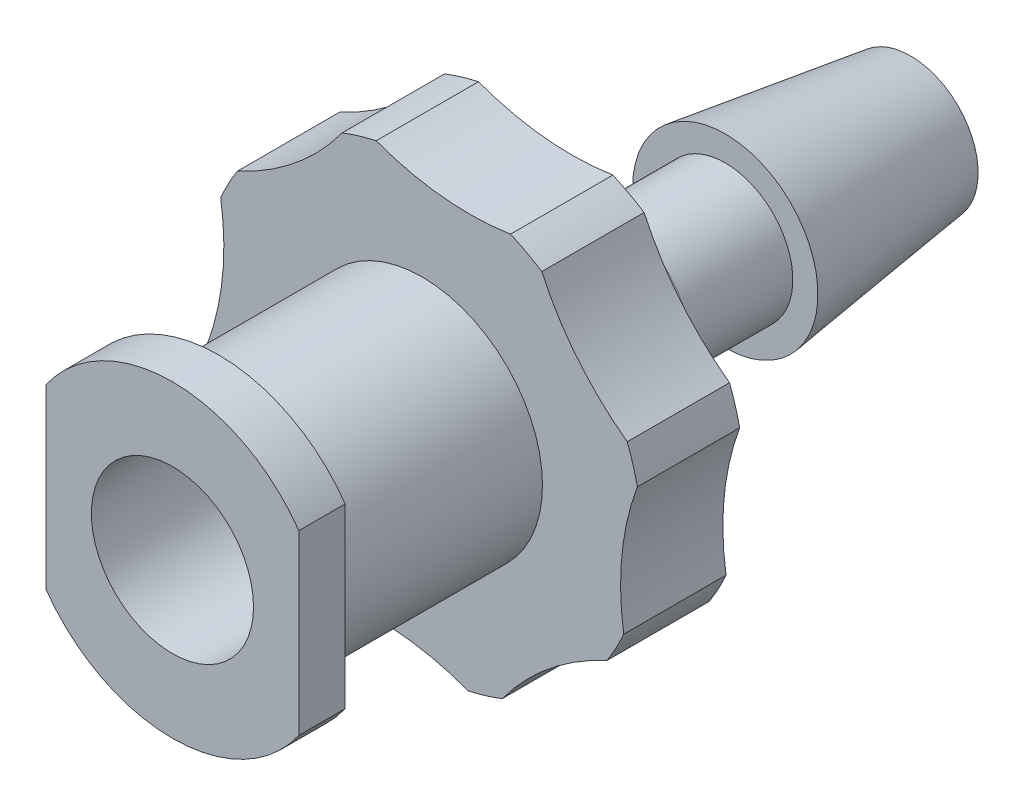
ISO-10303-21;
HEADER;
FILE_DESCRIPTION(('STEP AP214'),'2;1');
FILE_NAME('part.step','',(''),(''),'','','');
FILE_SCHEMA(('AUTOMOTIVE_DESIGN { 1 0 10303 214 1 1 1 1 }'));
ENDSEC;
DATA;
#1=APPLICATION_CONTEXT('core data for automotive mechanical design processes');
#2=APPLICATION_PROTOCOL_DEFINITION('international standard','automotive_design',2000,#1);
#3=PRODUCT_CONTEXT('',#1,'mechanical');
#4=PRODUCT('Part','Part','',(#3));
#5=PRODUCT_RELATED_PRODUCT_CATEGORY('part','',(#4));
#6=PRODUCT_DEFINITION_FORMATION('','',#4);
#7=PRODUCT_DEFINITION_CONTEXT('part definition',#1,'design');
#8=PRODUCT_DEFINITION('design','',#6,#7);
#9=PRODUCT_DEFINITION_SHAPE('','',#8);
#10=(LENGTH_UNIT() NAMED_UNIT(*) SI_UNIT(.MILLI.,.METRE.));
#11=(NAMED_UNIT(*) PLANE_ANGLE_UNIT() SI_UNIT($,.RADIAN.));
#12=(NAMED_UNIT(*) SI_UNIT($,.STERADIAN.) SOLID_ANGLE_UNIT());
#13=UNCERTAINTY_MEASURE_WITH_UNIT(LENGTH_MEASURE(1.E-05),#10,'distance_accuracy_value','');
#14=(GEOMETRIC_REPRESENTATION_CONTEXT(3) GLOBAL_UNCERTAINTY_ASSIGNED_CONTEXT((#13)) GLOBAL_UNIT_ASSIGNED_CONTEXT((#10,
#11,#12)) REPRESENTATION_CONTEXT('',''));
#15=CARTESIAN_POINT('',(0.,0.,0.));
#16=DIRECTION('',(0.,0.,1.));
#17=DIRECTION('',(1.,0.,0.));
#18=AXIS2_PLACEMENT_3D('',#15,#16,#17);
#19=CARTESIAN_POINT('',(0.,0.,10.56515173538));
#20=DIRECTION('',(0.,0.,1.));
#21=DIRECTION('',(1.,0.,0.));
#22=AXIS2_PLACEMENT_3D('',#19,#20,#21);
#23=CYLINDRICAL_SURFACE('',#22,3.705);
#24=DIRECTION('',(0.,0.,1.));
#25=VECTOR('',#24,1.);
#26=CARTESIAN_POINT('',(-2.01342596186961,-3.11016734213276,10.56515173538));
#27=LINE('',#26,#25);
#28=CARTESIAN_POINT('',(-2.01342596186961,-3.11016734213276,10.56515173538));
#29=VERTEX_POINT('',#28);
#30=CARTESIAN_POINT('',(-2.01342596186963,-3.11016734213279,12.28765173538));
#31=VERTEX_POINT('',#30);
#32=EDGE_CURVE('E50',#29,#31,#27,.T.);
#33=ORIENTED_EDGE('',*,*,#32,.F.);
#34=CARTESIAN_POINT('',(0.,0.,10.56515173538));
#35=DIRECTION('',(0.,0.,1.));
#36=DIRECTION('',(-1.,0.,0.));
#37=AXIS2_PLACEMENT_3D('',#34,#35,#36);
#38=CIRCLE('',#37,3.705);
#39=CARTESIAN_POINT('',(-1.48785096001638,-3.39312901622943,10.56515173538));
#40=VERTEX_POINT('',#39);
#41=EDGE_CURVE('E188',#29,#40,#38,.T.);
#42=ORIENTED_EDGE('',*,*,#41,.T.);
#43=DIRECTION('',(0.,0.,1.));
#44=VECTOR('',#43,1.);
#45=CARTESIAN_POINT('',(-1.48785096001638,-3.39312901622943,10.56515173538));
#46=LINE('',#45,#44);
#47=CARTESIAN_POINT('',(-1.48785096001638,-3.39312901622943,12.28765173538));
#48=VERTEX_POINT('',#47);
#49=EDGE_CURVE('E283',#40,#48,#46,.T.);
#50=ORIENTED_EDGE('',*,*,#49,.T.);
#51=CARTESIAN_POINT('',(0.,0.,12.28765173538));
#52=DIRECTION('',(0.,0.,1.));
#53=DIRECTION('',(-1.,0.,0.));
#54=AXIS2_PLACEMENT_3D('',#51,#52,#53);
#55=CIRCLE('',#54,3.705);
#56=EDGE_CURVE('E210',#31,#48,#55,.T.);
#57=ORIENTED_EDGE('',*,*,#56,.F.);
#58=EDGE_LOOP('',(#33,#42,#50,#57));
#59=FACE_BOUND('',#58,.T.);
#60=ADVANCED_FACE('F35',(#59),#23,.T.);
#61=DIRECTION('',(0.,0.,1.));
#62=VECTOR('',#61,1.);
#63=CARTESIAN_POINT('',(0.775513267191958,-3.62292756930207,10.56515173538));
#64=LINE('',#63,#62);
#65=CARTESIAN_POINT('',(0.775513267191958,-3.62292756930207,10.56515173538));
#66=VERTEX_POINT('',#65);
#67=CARTESIAN_POINT('',(0.775513267191965,-3.6229275693021,12.28765173538));
#68=VERTEX_POINT('',#67);
#69=EDGE_CURVE('E58',#66,#68,#64,.T.);
#70=ORIENTED_EDGE('',*,*,#69,.F.);
#71=CARTESIAN_POINT('',(1.34723503359417,-3.45137404003917,10.56515173538));
#72=VERTEX_POINT('',#71);
#73=EDGE_CURVE('E199',#66,#72,#38,.T.);
#74=ORIENTED_EDGE('',*,*,#73,.T.);
#75=DIRECTION('',(0.,0.,1.));
#76=VECTOR('',#75,1.);
#77=CARTESIAN_POINT('',(1.34723503359417,-3.45137404003917,10.56515173538));
#78=LINE('',#77,#76);
#79=CARTESIAN_POINT('',(1.34723503359417,-3.45137404003917,12.28765173538));
#80=VERTEX_POINT('',#79);
#81=EDGE_CURVE('E273',#72,#80,#78,.T.);
#82=ORIENTED_EDGE('',*,*,#81,.T.);
#83=EDGE_CURVE('E214',#68,#80,#55,.T.);
#84=ORIENTED_EDGE('',*,*,#83,.F.);
#85=EDGE_LOOP('',(#70,#74,#82,#84));
#86=FACE_BOUND('',#85,.T.);
#87=ADVANCED_FACE('F388',(#86),#23,.T.);
#88=DIRECTION('',(0.,0.,1.));
#89=VECTOR('',#88,1.);
#90=CARTESIAN_POINT('',(3.11016734213276,-2.01342596186962,10.56515173538));
#91=LINE('',#90,#89);
#92=CARTESIAN_POINT('',(3.11016734213276,-2.01342596186962,10.56515173538));
#93=VERTEX_POINT('',#92);
#94=CARTESIAN_POINT('',(3.11016734213279,-2.01342596186964,12.28765173538));
#95=VERTEX_POINT('',#94);
#96=EDGE_CURVE('E270',#93,#95,#91,.T.);
#97=ORIENTED_EDGE('',*,*,#96,.F.);
#98=CARTESIAN_POINT('',(3.39312901622943,-1.48785096001638,10.56515173538));
#99=VERTEX_POINT('',#98);
#100=EDGE_CURVE('E682',#93,#99,#38,.T.);
#101=ORIENTED_EDGE('',*,*,#100,.T.);
#102=DIRECTION('',(0.,0.,1.));
#103=VECTOR('',#102,1.);
#104=CARTESIAN_POINT('',(3.39312901622943,-1.48785096001638,10.56515173538));
#105=LINE('',#104,#103);
#106=CARTESIAN_POINT('',(3.39312901622943,-1.48785096001638,12.28765173538));
#107=VERTEX_POINT('',#106);
#108=EDGE_CURVE('E262',#99,#107,#105,.T.);
#109=ORIENTED_EDGE('',*,*,#108,.T.);
#110=EDGE_CURVE('E684',#95,#107,#55,.T.);
#111=ORIENTED_EDGE('',*,*,#110,.F.);
#112=EDGE_LOOP('',(#97,#101,#109,#111));
#113=FACE_BOUND('',#112,.T.);
#114=ADVANCED_FACE('F394',(#113),#23,.T.);
#115=DIRECTION('',(0.,0.,1.));
#116=VECTOR('',#115,1.);
#117=CARTESIAN_POINT('',(3.62292756930207,0.775513267191958,10.56515173538));
#118=LINE('',#117,#116);
#119=CARTESIAN_POINT('',(3.62292756930207,0.775513267191958,10.56515173538));
#120=VERTEX_POINT('',#119);
#121=CARTESIAN_POINT('',(3.6229275693021,0.775513267191965,12.28765173538));
#122=VERTEX_POINT('',#121);
#123=EDGE_CURVE('E259',#120,#122,#118,.T.);
#124=ORIENTED_EDGE('',*,*,#123,.F.);
#125=CARTESIAN_POINT('',(3.45137404003917,1.34723503359417,10.56515173538));
#126=VERTEX_POINT('',#125);
#127=EDGE_CURVE('E688',#120,#126,#38,.T.);
#128=ORIENTED_EDGE('',*,*,#127,.T.);
#129=DIRECTION('',(0.,0.,1.));
#130=VECTOR('',#129,1.);
#131=CARTESIAN_POINT('',(3.45137404003917,1.34723503359417,10.56515173538));
#132=LINE('',#131,#130);
#133=CARTESIAN_POINT('',(3.45137404003917,1.34723503359417,12.28765173538));
#134=VERTEX_POINT('',#133);
#135=EDGE_CURVE('E251',#126,#134,#132,.T.);
#136=ORIENTED_EDGE('',*,*,#135,.T.);
#137=EDGE_CURVE('E700',#122,#134,#55,.T.);
#138=ORIENTED_EDGE('',*,*,#137,.F.);
#139=EDGE_LOOP('',(#124,#128,#136,#138));
#140=FACE_BOUND('',#139,.T.);
#141=ADVANCED_FACE('F653',(#140),#23,.T.);
#142=DIRECTION('',(0.,0.,1.));
#143=VECTOR('',#142,1.);
#144=CARTESIAN_POINT('',(2.01342596186962,3.11016734213276,10.56515173538));
#145=LINE('',#144,#143);
#146=CARTESIAN_POINT('',(2.01342596186962,3.11016734213276,10.56515173538));
#147=VERTEX_POINT('',#146);
#148=CARTESIAN_POINT('',(2.01342596186964,3.11016734213279,12.28765173538));
#149=VERTEX_POINT('',#148);
#150=EDGE_CURVE('E248',#147,#149,#145,.T.);
#151=ORIENTED_EDGE('',*,*,#150,.F.);
#152=CARTESIAN_POINT('',(1.48785096001638,3.39312901622943,10.56515173538));
#153=VERTEX_POINT('',#152);
#154=EDGE_CURVE('E209',#147,#153,#38,.T.);
#155=ORIENTED_EDGE('',*,*,#154,.T.);
#156=DIRECTION('',(0.,0.,1.));
#157=VECTOR('',#156,1.);
#158=CARTESIAN_POINT('',(1.48785096001638,3.39312901622943,10.56515173538));
#159=LINE('',#158,#157);
#160=CARTESIAN_POINT('',(1.48785096001638,3.39312901622943,12.28765173538));
#161=VERTEX_POINT('',#160);
#162=EDGE_CURVE('E240',#153,#161,#159,.T.);
#163=ORIENTED_EDGE('',*,*,#162,.T.);
#164=EDGE_CURVE('E219',#149,#161,#55,.T.);
#165=ORIENTED_EDGE('',*,*,#164,.F.);
#166=EDGE_LOOP('',(#151,#155,#163,#165));
#167=FACE_BOUND('',#166,.T.);
#168=ADVANCED_FACE('F414',(#167),#23,.T.);
#169=DIRECTION('',(0.,0.,1.));
#170=VECTOR('',#169,1.);
#171=CARTESIAN_POINT('',(-0.775513267191957,3.62292756930207,10.56515173538));
#172=LINE('',#171,#170);
#173=CARTESIAN_POINT('',(-0.775513267191957,3.62292756930207,10.56515173538));
#174=VERTEX_POINT('',#173);
#175=CARTESIAN_POINT('',(-0.775513267191964,3.6229275693021,12.28765173538));
#176=VERTEX_POINT('',#175);
#177=EDGE_CURVE('E237',#174,#176,#172,.T.);
#178=ORIENTED_EDGE('',*,*,#177,.F.);
#179=CARTESIAN_POINT('',(-1.34723503359417,3.45137404003917,10.56515173538));
#180=VERTEX_POINT('',#179);
#181=EDGE_CURVE('E202',#174,#180,#38,.T.);
#182=ORIENTED_EDGE('',*,*,#181,.T.);
#183=DIRECTION('',(0.,0.,1.));
#184=VECTOR('',#183,1.);
#185=CARTESIAN_POINT('',(-1.34723503359417,3.45137404003917,10.56515173538));
#186=LINE('',#185,#184);
#187=CARTESIAN_POINT('',(-1.34723503359417,3.45137404003917,12.28765173538));
#188=VERTEX_POINT('',#187);
#189=EDGE_CURVE('E229',#180,#188,#186,.T.);
#190=ORIENTED_EDGE('',*,*,#189,.T.);
#191=EDGE_CURVE('E215',#176,#188,#55,.T.);
#192=ORIENTED_EDGE('',*,*,#191,.F.);
#193=EDGE_LOOP('',(#178,#182,#190,#192));
#194=FACE_BOUND('',#193,.T.);
#195=ADVANCED_FACE('F409',(#194),#23,.T.);
#196=DIRECTION('',(0.,0.,1.));
#197=VECTOR('',#196,1.);
#198=CARTESIAN_POINT('',(-3.11016734213276,2.01342596186962,10.56515173538));
#199=LINE('',#198,#197);
#200=CARTESIAN_POINT('',(-3.11016734213276,2.01342596186962,10.56515173538));
#201=VERTEX_POINT('',#200);
#202=CARTESIAN_POINT('',(-3.11016734213279,2.01342596186964,12.28765173538));
#203=VERTEX_POINT('',#202);
#204=EDGE_CURVE('E227',#201,#203,#199,.T.);
#205=ORIENTED_EDGE('',*,*,#204,.F.);
#206=CARTESIAN_POINT('',(-3.39312901622945,1.48785096001638,10.56515173538));
#207=VERTEX_POINT('',#206);
#208=EDGE_CURVE('E195',#201,#207,#38,.T.);
#209=ORIENTED_EDGE('',*,*,#208,.T.);
#210=DIRECTION('',(0.,0.,1.));
#211=VECTOR('',#210,1.);
#212=CARTESIAN_POINT('',(-3.39312901622945,1.48785096001638,10.56515173538));
#213=LINE('',#212,#211);
#214=CARTESIAN_POINT('',(-3.39312901622945,1.48785096001638,12.28765173538));
#215=VERTEX_POINT('',#214);
#216=EDGE_CURVE('E220',#207,#215,#213,.T.);
#217=ORIENTED_EDGE('',*,*,#216,.T.);
#218=EDGE_CURVE('E211',#203,#215,#55,.T.);
#219=ORIENTED_EDGE('',*,*,#218,.F.);
#220=EDGE_LOOP('',(#205,#209,#217,#219));
#221=FACE_BOUND('',#220,.T.);
#222=ADVANCED_FACE('F399',(#221),#23,.T.);
#223=CARTESIAN_POINT('',(0.,0.,15.71315173538));
#224=DIRECTION('',(0.,0.,1.));
#225=DIRECTION('',(1.,0.,0.));
#226=AXIS2_PLACEMENT_3D('',#223,#224,#225);
#227=CYLINDRICAL_SURFACE('',#226,2.6);
#228=CARTESIAN_POINT('',(0.,0.,16.49315173538));
#229=DIRECTION('',(0.,0.,1.));
#230=DIRECTION('',(1.,0.,0.));
#231=AXIS2_PLACEMENT_3D('',#228,#229,#230);
#232=CIRCLE('',#231,2.6);
#233=CARTESIAN_POINT('',(2.12875,1.4927904868065,16.49315173538));
#234=VERTEX_POINT('',#233);
#235=CARTESIAN_POINT('',(-2.12875,1.4927904868065,16.49315173538));
#236=VERTEX_POINT('',#235);
#237=EDGE_CURVE('E197',#234,#236,#232,.T.);
#238=ORIENTED_EDGE('',*,*,#237,.F.);
#239=DIRECTION('',(0.,0.,1.));
#240=VECTOR('',#239,1.);
#241=CARTESIAN_POINT('',(2.12875,1.4927904868065,15.71315173538));
#242=LINE('',#241,#240);
#243=CARTESIAN_POINT('',(2.12875,1.4927904868065,15.71315173538));
#244=VERTEX_POINT('',#243);
#245=EDGE_CURVE('E343',#244,#234,#242,.T.);
#246=ORIENTED_EDGE('',*,*,#245,.F.);
#247=CARTESIAN_POINT('',(0.,0.,15.71315173538));
#248=DIRECTION('',(0.,0.,1.));
#249=DIRECTION('',(1.,0.,0.));
#250=AXIS2_PLACEMENT_3D('',#247,#248,#249);
#251=CIRCLE('',#250,2.6);
#252=CARTESIAN_POINT('',(-2.12875,1.4927904868065,15.71315173538));
#253=VERTEX_POINT('',#252);
#254=EDGE_CURVE('E342',#244,#253,#251,.T.);
#255=ORIENTED_EDGE('',*,*,#254,.T.);
#256=DIRECTION('',(0.,0.,1.));
#257=VECTOR('',#256,1.);
#258=CARTESIAN_POINT('',(-2.12875,1.4927904868065,15.71315173538));
#259=LINE('',#258,#257);
#260=EDGE_CURVE('E350',#253,#236,#259,.T.);
#261=ORIENTED_EDGE('',*,*,#260,.T.);
#262=EDGE_LOOP('',(#238,#246,#255,#261));
#263=FACE_BOUND('',#262,.T.);
#264=ADVANCED_FACE('F374',(#263),#227,.T.);
#265=CARTESIAN_POINT('',(2.12875,-1.49279048680651,15.71315173538));
#266=DIRECTION('',(1.,0.,0.));
#267=DIRECTION('',(0.,1.,0.));
#268=AXIS2_PLACEMENT_3D('',#265,#266,#267);
#269=PLANE('',#268);
#270=DIRECTION('',(0.,1.,0.));
#271=VECTOR('',#270,1.);
#272=CARTESIAN_POINT('',(2.12875,-1.49279048680651,16.49315173538));
#273=LINE('',#272,#271);
#274=CARTESIAN_POINT('',(2.12875,-1.49279048680651,16.49315173538));
#275=VERTEX_POINT('',#274);
#276=EDGE_CURVE('E331',#275,#234,#273,.T.);
#277=ORIENTED_EDGE('',*,*,#276,.F.);
#278=DIRECTION('',(0.,0.,1.));
#279=VECTOR('',#278,1.);
#280=CARTESIAN_POINT('',(2.12875,-1.49279048680651,15.71315173538));
#281=LINE('',#280,#279);
#282=CARTESIAN_POINT('',(2.12875,-1.49279048680651,15.71315173538));
#283=VERTEX_POINT('',#282);
#284=EDGE_CURVE('E346',#283,#275,#281,.T.);
#285=ORIENTED_EDGE('',*,*,#284,.F.);
#286=DIRECTION('',(0.,1.,0.));
#287=VECTOR('',#286,1.);
#288=CARTESIAN_POINT('',(2.12875,-1.49279048680651,15.71315173538));
#289=LINE('',#288,#287);
#290=EDGE_CURVE('E337',#283,#244,#289,.T.);
#291=ORIENTED_EDGE('',*,*,#290,.T.);
#292=ORIENTED_EDGE('',*,*,#245,.T.);
#293=EDGE_LOOP('',(#277,#285,#291,#292));
#294=FACE_BOUND('',#293,.T.);
#295=ADVANCED_FACE('F370',(#294),#269,.T.);
#296=CARTESIAN_POINT('',(0.,0.,15.71315173538));
#297=DIRECTION('',(0.,0.,1.));
#298=DIRECTION('',(1.,0.,0.));
#299=AXIS2_PLACEMENT_3D('',#296,#297,#298);
#300=CYLINDRICAL_SURFACE('',#299,2.6);
#301=CARTESIAN_POINT('',(0.,0.,16.49315173538));
#302=DIRECTION('',(0.,0.,1.));
#303=DIRECTION('',(1.,0.,0.));
#304=AXIS2_PLACEMENT_3D('',#301,#302,#303);
#305=CIRCLE('',#304,2.6);
#306=CARTESIAN_POINT('',(-2.12875,-1.4927904868065,16.49315173538));
#307=VERTEX_POINT('',#306);
#308=EDGE_CURVE('E334',#307,#275,#305,.T.);
#309=ORIENTED_EDGE('',*,*,#308,.F.);
#310=DIRECTION('',(0.,0.,1.));
#311=VECTOR('',#310,1.);
#312=CARTESIAN_POINT('',(-2.12875,-1.4927904868065,15.71315173538));
#313=LINE('',#312,#311);
#314=CARTESIAN_POINT('',(-2.12875,-1.4927904868065,15.71315173538));
#315=VERTEX_POINT('',#314);
#316=EDGE_CURVE('E348',#315,#307,#313,.T.);
#317=ORIENTED_EDGE('',*,*,#316,.F.);
#318=CARTESIAN_POINT('',(0.,0.,15.71315173538));
#319=DIRECTION('',(0.,0.,1.));
#320=DIRECTION('',(1.,0.,0.));
#321=AXIS2_PLACEMENT_3D('',#318,#319,#320);
#322=CIRCLE('',#321,2.6);
#323=EDGE_CURVE('E363',#315,#283,#322,.T.);
#324=ORIENTED_EDGE('',*,*,#323,.T.);
#325=ORIENTED_EDGE('',*,*,#284,.T.);
#326=EDGE_LOOP('',(#309,#317,#324,#325));
#327=FACE_BOUND('',#326,.T.);
#328=ADVANCED_FACE('F378',(#327),#300,.T.);
#329=CARTESIAN_POINT('',(-2.12875,1.4927904868065,15.71315173538));
#330=DIRECTION('',(-1.,0.,0.));
#331=DIRECTION('',(0.,-1.,0.));
#332=AXIS2_PLACEMENT_3D('',#329,#330,#331);
#333=PLANE('',#332);
#334=DIRECTION('',(0.,-1.,0.));
#335=VECTOR('',#334,1.);
#336=CARTESIAN_POINT('',(-2.12875,1.4927904868065,16.49315173538));
#337=LINE('',#336,#335);
#338=EDGE_CURVE('E329',#236,#307,#337,.T.);
#339=ORIENTED_EDGE('',*,*,#338,.F.);
#340=ORIENTED_EDGE('',*,*,#260,.F.);
#341=DIRECTION('',(0.,-1.,0.));
#342=VECTOR('',#341,1.);
#343=CARTESIAN_POINT('',(-2.12875,1.4927904868065,15.71315173538));
#344=LINE('',#343,#342);
#345=EDGE_CURVE('E361',#253,#315,#344,.T.);
#346=ORIENTED_EDGE('',*,*,#345,.T.);
#347=ORIENTED_EDGE('',*,*,#316,.T.);
#348=EDGE_LOOP('',(#339,#340,#346,#347));
#349=FACE_BOUND('',#348,.T.);
#350=ADVANCED_FACE('F376',(#349),#333,.T.);
#351=CARTESIAN_POINT('',(0.,0.,15.71315173538));
#352=DIRECTION('',(0.,0.,1.));
#353=DIRECTION('',(1.,0.,0.));
#354=AXIS2_PLACEMENT_3D('',#351,#352,#353);
#355=PLANE('',#354);
#356=CARTESIAN_POINT('',(0.,0.,15.71315173538));
#357=DIRECTION('',(0.,0.,-1.));
#358=DIRECTION('',(-1.,0.,0.));
#359=AXIS2_PLACEMENT_3D('',#356,#357,#358);
#360=CIRCLE('',#359,2.02475);
#361=CARTESIAN_POINT('',(-2.02475,0.,15.71315173538));
#362=VERTEX_POINT('',#361);
#363=EDGE_CURVE('E345',#362,#362,#360,.T.);
#364=ORIENTED_EDGE('',*,*,#363,.F.);
#365=EDGE_LOOP('',(#364));
#366=FACE_BOUND('',#365,.T.);
#367=ORIENTED_EDGE('',*,*,#254,.F.);
#368=ORIENTED_EDGE('',*,*,#290,.F.);
#369=ORIENTED_EDGE('',*,*,#323,.F.);
#370=ORIENTED_EDGE('',*,*,#345,.F.);
#371=EDGE_LOOP('',(#367,#368,#369,#370));
#372=FACE_BOUND('',#371,.T.);
#373=ADVANCED_FACE('F321',(#366,#372),#355,.F.);
#374=CARTESIAN_POINT('',(0.,0.,16.49315173538));
#375=DIRECTION('',(0.,0.,1.));
#376=DIRECTION('',(1.,0.,0.));
#377=AXIS2_PLACEMENT_3D('',#374,#375,#376);
#378=PLANE('',#377);
#379=CARTESIAN_POINT('',(0.,0.,16.49315173538));
#380=DIRECTION('',(0.,0.,1.));
#381=DIRECTION('',(1.,0.,0.));
#382=AXIS2_PLACEMENT_3D('',#379,#380,#381);
#383=CIRCLE('',#382,1.365);
#384=CARTESIAN_POINT('',(1.365,0.,16.49315173538));
#385=VERTEX_POINT('',#384);
#386=EDGE_CURVE('E311',#385,#385,#383,.T.);
#387=ORIENTED_EDGE('',*,*,#386,.F.);
#388=EDGE_LOOP('',(#387));
#389=FACE_BOUND('',#388,.T.);
#390=ORIENTED_EDGE('',*,*,#237,.T.);
#391=ORIENTED_EDGE('',*,*,#338,.T.);
#392=ORIENTED_EDGE('',*,*,#308,.T.);
#393=ORIENTED_EDGE('',*,*,#276,.T.);
#394=EDGE_LOOP('',(#390,#391,#392,#393));
#395=FACE_BOUND('',#394,.T.);
#396=ADVANCED_FACE('F317',(#389,#395),#378,.T.);
#397=CARTESIAN_POINT('',(0.,0.,12.28765173538));
#398=DIRECTION('',(0.,0.,1.));
#399=DIRECTION('',(1.,0.,0.));
#400=AXIS2_PLACEMENT_3D('',#397,#398,#399);
#401=CYLINDRICAL_SURFACE('',#400,2.02475);
#402=CARTESIAN_POINT('',(0.,0.,12.28765173538));
#403=DIRECTION('',(0.,0.,-1.));
#404=DIRECTION('',(-1.,0.,0.));
#405=AXIS2_PLACEMENT_3D('',#402,#403,#404);
#406=CIRCLE('',#405,2.02475);
#407=CARTESIAN_POINT('',(-2.02475,0.,12.28765173538));
#408=VERTEX_POINT('',#407);
#409=EDGE_CURVE('E193',#408,#408,#406,.T.);
#410=ORIENTED_EDGE('',*,*,#409,.F.);
#411=EDGE_LOOP('',(#410));
#412=FACE_BOUND('',#411,.T.);
#413=ORIENTED_EDGE('',*,*,#363,.T.);
#414=EDGE_LOOP('',(#413));
#415=FACE_BOUND('',#414,.T.);
#416=ADVANCED_FACE('F320',(#412,#415),#401,.T.);
#417=DIRECTION('',(0.,0.,1.));
#418=VECTOR('',#417,1.);
#419=CARTESIAN_POINT('',(-3.45137404003917,-1.34723503359417,10.56515173538));
#420=LINE('',#419,#418);
#421=CARTESIAN_POINT('',(-3.45137404003917,-1.34723503359417,10.56515173538));
#422=VERTEX_POINT('',#421);
#423=CARTESIAN_POINT('',(-3.45137404003917,-1.34723503359417,12.28765173538));
#424=VERTEX_POINT('',#423);
#425=EDGE_CURVE('E171',#422,#424,#420,.T.);
#426=ORIENTED_EDGE('',*,*,#425,.T.);
#427=CARTESIAN_POINT('',(-3.62292756930209,-0.775513267192013,12.28765173538));
#428=VERTEX_POINT('',#427);
#429=EDGE_CURVE('E203',#428,#424,#55,.T.);
#430=ORIENTED_EDGE('',*,*,#429,.F.);
#431=DIRECTION('',(0.,0.,1.));
#432=VECTOR('',#431,1.);
#433=CARTESIAN_POINT('',(-3.62292756930208,-0.77551326719201,10.56515173538));
#434=LINE('',#433,#432);
#435=CARTESIAN_POINT('',(-3.62292756930208,-0.77551326719201,10.56515173538));
#436=VERTEX_POINT('',#435);
#437=EDGE_CURVE('E192',#436,#428,#434,.T.);
#438=ORIENTED_EDGE('',*,*,#437,.F.);
#439=EDGE_CURVE('E186',#436,#422,#38,.T.);
#440=ORIENTED_EDGE('',*,*,#439,.T.);
#441=EDGE_LOOP('',(#426,#430,#438,#440));
#442=FACE_BOUND('',#441,.T.);
#443=ADVANCED_FACE('F191',(#442),#23,.T.);
#444=CARTESIAN_POINT('',(0.,0.,10.56515173538));
#445=DIRECTION('',(0.,0.,-1.));
#446=DIRECTION('',(-1.,0.,0.));
#447=AXIS2_PLACEMENT_3D('',#444,#445,#446);
#448=PLANE('',#447);
#449=CARTESIAN_POINT('',(0.,0.,10.56515173538));
#450=DIRECTION('',(0.,0.,-1.));
#451=DIRECTION('',(-1.,0.,0.));
#452=AXIS2_PLACEMENT_3D('',#449,#450,#451);
#453=CIRCLE('',#452,1.52750000000371);
#454=CARTESIAN_POINT('',(-1.52750000000371,0.,10.56515173538));
#455=VERTEX_POINT('',#454);
#456=EDGE_CURVE('E11',#455,#455,#453,.F.);
#457=ORIENTED_EDGE('',*,*,#456,.T.);
#458=EDGE_LOOP('',(#457));
#459=FACE_BOUND('',#458,.T.);
#460=CARTESIAN_POINT('',(-6.1081245560021,-4.98213455161213,10.56515173538));
#461=DIRECTION('',(0.,0.,1.));
#462=DIRECTION('',(1.,0.,0.));
#463=AXIS2_PLACEMENT_3D('',#460,#461,#462);
#464=CIRCLE('',#463,4.50231249583551);
#465=EDGE_CURVE('E174',#29,#422,#464,.T.);
#466=ORIENTED_EDGE('',*,*,#465,.T.);
#467=ORIENTED_EDGE('',*,*,#439,.F.);
#468=CARTESIAN_POINT('',(-7.84199742010991,0.796195167652423,10.56515173538));
#469=DIRECTION('',(0.,0.,1.));
#470=DIRECTION('',(1.,0.,0.));
#471=AXIS2_PLACEMENT_3D('',#468,#469,#470);
#472=CIRCLE('',#471,4.50231249583551);
#473=EDGE_CURVE('E223',#436,#207,#472,.T.);
#474=ORIENTED_EDGE('',*,*,#473,.T.);
#475=ORIENTED_EDGE('',*,*,#208,.F.);
#476=CARTESIAN_POINT('',(-4.98213455161213,6.10812455600211,10.56515173538));
#477=DIRECTION('',(0.,0.,1.));
#478=DIRECTION('',(1.,0.,0.));
#479=AXIS2_PLACEMENT_3D('',#476,#477,#478);
#480=CIRCLE('',#479,4.50231249583551);
#481=EDGE_CURVE('E232',#201,#180,#480,.T.);
#482=ORIENTED_EDGE('',*,*,#481,.T.);
#483=ORIENTED_EDGE('',*,*,#181,.F.);
#484=CARTESIAN_POINT('',(0.796195167652424,7.84199742010991,10.56515173538));
#485=DIRECTION('',(0.,0.,1.));
#486=DIRECTION('',(1.,0.,0.));
#487=AXIS2_PLACEMENT_3D('',#484,#485,#486);
#488=CIRCLE('',#487,4.50231249583551);
#489=EDGE_CURVE('E243',#174,#153,#488,.T.);
#490=ORIENTED_EDGE('',*,*,#489,.T.);
#491=ORIENTED_EDGE('',*,*,#154,.F.);
#492=CARTESIAN_POINT('',(6.10812455600211,4.98213455161213,10.56515173538));
#493=DIRECTION('',(0.,0.,1.));
#494=DIRECTION('',(1.,0.,0.));
#495=AXIS2_PLACEMENT_3D('',#492,#493,#494);
#496=CIRCLE('',#495,4.50231249583551);
#497=EDGE_CURVE('E254',#147,#126,#496,.T.);
#498=ORIENTED_EDGE('',*,*,#497,.T.);
#499=ORIENTED_EDGE('',*,*,#127,.F.);
#500=CARTESIAN_POINT('',(7.84199742010991,-0.796195167652424,10.56515173538));
#501=DIRECTION('',(0.,0.,1.));
#502=DIRECTION('',(1.,0.,0.));
#503=AXIS2_PLACEMENT_3D('',#500,#501,#502);
#504=CIRCLE('',#503,4.50231249583551);
#505=EDGE_CURVE('E265',#120,#99,#504,.T.);
#506=ORIENTED_EDGE('',*,*,#505,.T.);
#507=ORIENTED_EDGE('',*,*,#100,.F.);
#508=CARTESIAN_POINT('',(4.98213455161213,-6.10812455600211,10.56515173538));
#509=DIRECTION('',(0.,0.,1.));
#510=DIRECTION('',(1.,0.,0.));
#511=AXIS2_PLACEMENT_3D('',#508,#509,#510);
#512=CIRCLE('',#511,4.50231249583551);
#513=EDGE_CURVE('E276',#93,#72,#512,.T.);
#514=ORIENTED_EDGE('',*,*,#513,.T.);
#515=ORIENTED_EDGE('',*,*,#73,.F.);
#516=CARTESIAN_POINT('',(-0.796195167652423,-7.84199742010991,10.56515173538));
#517=DIRECTION('',(0.,0.,1.));
#518=DIRECTION('',(1.,0.,0.));
#519=AXIS2_PLACEMENT_3D('',#516,#517,#518);
#520=CIRCLE('',#519,4.50231249583551);
#521=EDGE_CURVE('E286',#66,#40,#520,.T.);
#522=ORIENTED_EDGE('',*,*,#521,.T.);
#523=ORIENTED_EDGE('',*,*,#41,.F.);
#524=EDGE_LOOP('',(#466,#467,#474,#475,#482,#483,#490,#491,#498,#499,#506,#507,#514,#515,#522,#523));
#525=FACE_BOUND('',#524,.T.);
#526=ADVANCED_FACE('F184',(#459,#525),#448,.T.);
#527=CARTESIAN_POINT('',(0.,0.,12.28765173538));
#528=DIRECTION('',(0.,0.,-1.));
#529=DIRECTION('',(-1.,0.,0.));
#530=AXIS2_PLACEMENT_3D('',#527,#528,#529);
#531=PLANE('',#530);
#532=ORIENTED_EDGE('',*,*,#409,.T.);
#533=EDGE_LOOP('',(#532));
#534=FACE_BOUND('',#533,.T.);
#535=ORIENTED_EDGE('',*,*,#429,.T.);
#536=CARTESIAN_POINT('',(-6.1081245560021,-4.98213455161213,12.28765173538));
#537=DIRECTION('',(0.,0.,1.));
#538=DIRECTION('',(1.,0.,0.));
#539=AXIS2_PLACEMENT_3D('',#536,#537,#538);
#540=CIRCLE('',#539,4.50231249583551);
#541=EDGE_CURVE('E175',#31,#424,#540,.T.);
#542=ORIENTED_EDGE('',*,*,#541,.F.);
#543=ORIENTED_EDGE('',*,*,#56,.T.);
#544=CARTESIAN_POINT('',(-0.796195167652423,-7.84199742010991,12.28765173538));
#545=DIRECTION('',(0.,0.,1.));
#546=DIRECTION('',(1.,0.,0.));
#547=AXIS2_PLACEMENT_3D('',#544,#545,#546);
#548=CIRCLE('',#547,4.50231249583551);
#549=EDGE_CURVE('E288',#68,#48,#548,.T.);
#550=ORIENTED_EDGE('',*,*,#549,.F.);
#551=ORIENTED_EDGE('',*,*,#83,.T.);
#552=CARTESIAN_POINT('',(4.98213455161213,-6.10812455600211,12.28765173538));
#553=DIRECTION('',(0.,0.,1.));
#554=DIRECTION('',(1.,0.,0.));
#555=AXIS2_PLACEMENT_3D('',#552,#553,#554);
#556=CIRCLE('',#555,4.50231249583551);
#557=EDGE_CURVE('E278',#95,#80,#556,.T.);
#558=ORIENTED_EDGE('',*,*,#557,.F.);
#559=ORIENTED_EDGE('',*,*,#110,.T.);
#560=CARTESIAN_POINT('',(7.84199742010991,-0.796195167652424,12.28765173538));
#561=DIRECTION('',(0.,0.,1.));
#562=DIRECTION('',(1.,0.,0.));
#563=AXIS2_PLACEMENT_3D('',#560,#561,#562);
#564=CIRCLE('',#563,4.50231249583551);
#565=EDGE_CURVE('E267',#122,#107,#564,.T.);
#566=ORIENTED_EDGE('',*,*,#565,.F.);
#567=ORIENTED_EDGE('',*,*,#137,.T.);
#568=CARTESIAN_POINT('',(6.10812455600211,4.98213455161213,12.28765173538));
#569=DIRECTION('',(0.,0.,1.));
#570=DIRECTION('',(1.,0.,0.));
#571=AXIS2_PLACEMENT_3D('',#568,#569,#570);
#572=CIRCLE('',#571,4.50231249583551);
#573=EDGE_CURVE('E256',#149,#134,#572,.T.);
#574=ORIENTED_EDGE('',*,*,#573,.F.);
#575=ORIENTED_EDGE('',*,*,#164,.T.);
#576=CARTESIAN_POINT('',(0.796195167652424,7.84199742010991,12.28765173538));
#577=DIRECTION('',(0.,0.,1.));
#578=DIRECTION('',(1.,0.,0.));
#579=AXIS2_PLACEMENT_3D('',#576,#577,#578);
#580=CIRCLE('',#579,4.50231249583551);
#581=EDGE_CURVE('E245',#176,#161,#580,.T.);
#582=ORIENTED_EDGE('',*,*,#581,.F.);
#583=ORIENTED_EDGE('',*,*,#191,.T.);
#584=CARTESIAN_POINT('',(-4.98213455161213,6.10812455600211,12.28765173538));
#585=DIRECTION('',(0.,0.,1.));
#586=DIRECTION('',(1.,0.,0.));
#587=AXIS2_PLACEMENT_3D('',#584,#585,#586);
#588=CIRCLE('',#587,4.50231249583551);
#589=EDGE_CURVE('E234',#203,#188,#588,.T.);
#590=ORIENTED_EDGE('',*,*,#589,.F.);
#591=ORIENTED_EDGE('',*,*,#218,.T.);
#592=CARTESIAN_POINT('',(-7.84199742010991,0.796195167652423,12.28765173538));
#593=DIRECTION('',(0.,0.,1.));
#594=DIRECTION('',(1.,0.,0.));
#595=AXIS2_PLACEMENT_3D('',#592,#593,#594);
#596=CIRCLE('',#595,4.50231249583551);
#597=EDGE_CURVE('E225',#428,#215,#596,.T.);
#598=ORIENTED_EDGE('',*,*,#597,.F.);
#599=EDGE_LOOP('',(#535,#542,#543,#550,#551,#558,#559,#566,#567,#574,#575,#582,#583,#590,#591,#598));
#600=FACE_BOUND('',#599,.T.);
#601=ADVANCED_FACE('F404',(#534,#600),#531,.F.);
#602=CARTESIAN_POINT('',(-7.84199742010991,0.796195167652423,10.56515173538));
#603=DIRECTION('',(0.,0.,1.));
#604=DIRECTION('',(1.,0.,0.));
#605=AXIS2_PLACEMENT_3D('',#602,#603,#604);
#606=CYLINDRICAL_SURFACE('',#605,4.50231249583551);
#607=ORIENTED_EDGE('',*,*,#597,.T.);
#608=ORIENTED_EDGE('',*,*,#216,.F.);
#609=ORIENTED_EDGE('',*,*,#473,.F.);
#610=ORIENTED_EDGE('',*,*,#437,.T.);
#611=EDGE_LOOP('',(#607,#608,#609,#610));
#612=FACE_BOUND('',#611,.T.);
#613=ADVANCED_FACE('F418',(#612),#606,.F.);
#614=CARTESIAN_POINT('',(-4.98213455161213,6.10812455600211,10.56515173538));
#615=DIRECTION('',(0.,0.,1.));
#616=DIRECTION('',(1.,0.,0.));
#617=AXIS2_PLACEMENT_3D('',#614,#615,#616);
#618=CYLINDRICAL_SURFACE('',#617,4.50231249583551);
#619=ORIENTED_EDGE('',*,*,#589,.T.);
#620=ORIENTED_EDGE('',*,*,#189,.F.);
#621=ORIENTED_EDGE('',*,*,#481,.F.);
#622=ORIENTED_EDGE('',*,*,#204,.T.);
#623=EDGE_LOOP('',(#619,#620,#621,#622));
#624=FACE_BOUND('',#623,.T.);
#625=ADVANCED_FACE('F424',(#624),#618,.F.);
#626=CARTESIAN_POINT('',(0.796195167652424,7.84199742010991,10.56515173538));
#627=DIRECTION('',(0.,0.,1.));
#628=DIRECTION('',(1.,0.,0.));
#629=AXIS2_PLACEMENT_3D('',#626,#627,#628);
#630=CYLINDRICAL_SURFACE('',#629,4.50231249583551);
#631=ORIENTED_EDGE('',*,*,#581,.T.);
#632=ORIENTED_EDGE('',*,*,#162,.F.);
#633=ORIENTED_EDGE('',*,*,#489,.F.);
#634=ORIENTED_EDGE('',*,*,#177,.T.);
#635=EDGE_LOOP('',(#631,#632,#633,#634));
#636=FACE_BOUND('',#635,.T.);
#637=ADVANCED_FACE('F429',(#636),#630,.F.);
#638=CARTESIAN_POINT('',(6.10812455600211,4.98213455161213,10.56515173538));
#639=DIRECTION('',(0.,0.,1.));
#640=DIRECTION('',(1.,0.,0.));
#641=AXIS2_PLACEMENT_3D('',#638,#639,#640);
#642=CYLINDRICAL_SURFACE('',#641,4.50231249583551);
#643=ORIENTED_EDGE('',*,*,#573,.T.);
#644=ORIENTED_EDGE('',*,*,#135,.F.);
#645=ORIENTED_EDGE('',*,*,#497,.F.);
#646=ORIENTED_EDGE('',*,*,#150,.T.);
#647=EDGE_LOOP('',(#643,#644,#645,#646));
#648=FACE_BOUND('',#647,.T.);
#649=ADVANCED_FACE('F432',(#648),#642,.F.);
#650=CARTESIAN_POINT('',(7.84199742010991,-0.796195167652424,10.56515173538));
#651=DIRECTION('',(0.,0.,1.));
#652=DIRECTION('',(1.,0.,0.));
#653=AXIS2_PLACEMENT_3D('',#650,#651,#652);
#654=CYLINDRICAL_SURFACE('',#653,4.50231249583551);
#655=ORIENTED_EDGE('',*,*,#565,.T.);
#656=ORIENTED_EDGE('',*,*,#108,.F.);
#657=ORIENTED_EDGE('',*,*,#505,.F.);
#658=ORIENTED_EDGE('',*,*,#123,.T.);
#659=EDGE_LOOP('',(#655,#656,#657,#658));
#660=FACE_BOUND('',#659,.T.);
#661=ADVANCED_FACE('F436',(#660),#654,.F.);
#662=CARTESIAN_POINT('',(4.98213455161213,-6.10812455600211,10.56515173538));
#663=DIRECTION('',(0.,0.,1.));
#664=DIRECTION('',(1.,0.,0.));
#665=AXIS2_PLACEMENT_3D('',#662,#663,#664);
#666=CYLINDRICAL_SURFACE('',#665,4.50231249583551);
#667=ORIENTED_EDGE('',*,*,#557,.T.);
#668=ORIENTED_EDGE('',*,*,#81,.F.);
#669=ORIENTED_EDGE('',*,*,#513,.F.);
#670=ORIENTED_EDGE('',*,*,#96,.T.);
#671=EDGE_LOOP('',(#667,#668,#669,#670));
#672=FACE_BOUND('',#671,.T.);
#673=ADVANCED_FACE('F440',(#672),#666,.F.);
#674=CARTESIAN_POINT('',(-0.796195167652423,-7.84199742010991,10.56515173538));
#675=DIRECTION('',(0.,0.,1.));
#676=DIRECTION('',(1.,0.,0.));
#677=AXIS2_PLACEMENT_3D('',#674,#675,#676);
#678=CYLINDRICAL_SURFACE('',#677,4.50231249583551);
#679=ORIENTED_EDGE('',*,*,#549,.T.);
#680=ORIENTED_EDGE('',*,*,#49,.F.);
#681=ORIENTED_EDGE('',*,*,#521,.F.);
#682=ORIENTED_EDGE('',*,*,#69,.T.);
#683=EDGE_LOOP('',(#679,#680,#681,#682));
#684=FACE_BOUND('',#683,.T.);
#685=ADVANCED_FACE('F444',(#684),#678,.F.);
#686=CARTESIAN_POINT('',(-6.1081245560021,-4.98213455161213,10.56515173538));
#687=DIRECTION('',(0.,0.,1.));
#688=DIRECTION('',(1.,0.,0.));
#689=AXIS2_PLACEMENT_3D('',#686,#687,#688);
#690=CYLINDRICAL_SURFACE('',#689,4.50231249583551);
#691=ORIENTED_EDGE('',*,*,#541,.T.);
#692=ORIENTED_EDGE('',*,*,#425,.F.);
#693=ORIENTED_EDGE('',*,*,#465,.F.);
#694=ORIENTED_EDGE('',*,*,#32,.T.);
#695=EDGE_LOOP('',(#691,#692,#693,#694));
#696=FACE_BOUND('',#695,.T.);
#697=ADVANCED_FACE('F173',(#696),#690,.F.);
#698=CARTESIAN_POINT('',(0.,0.,10.56515173538));
#699=DIRECTION('',(0.,0.,-1.));
#700=DIRECTION('',(-1.,0.,0.));
#701=AXIS2_PLACEMENT_3D('',#698,#699,#700);
#702=CYLINDRICAL_SURFACE('',#701,1.1375);
#703=CARTESIAN_POINT('',(0.,0.,8.94015173538144));
#704=DIRECTION('',(0.,0.,-1.));
#705=DIRECTION('',(-1.,0.,0.));
#706=AXIS2_PLACEMENT_3D('',#703,#704,#705);
#707=CIRCLE('',#706,1.1375);
#708=CARTESIAN_POINT('',(-1.1375,0.,8.94015173538144));
#709=VERTEX_POINT('',#708);
#710=EDGE_CURVE('E43',#709,#709,#707,.T.);
#711=ORIENTED_EDGE('',*,*,#710,.T.);
#712=EDGE_LOOP('',(#711));
#713=FACE_BOUND('',#712,.T.);
#714=CARTESIAN_POINT('',(0.,0.,7.18515173537997));
#715=DIRECTION('',(0.,0.,-1.));
#716=DIRECTION('',(-1.,0.,0.));
#717=AXIS2_PLACEMENT_3D('',#714,#715,#716);
#718=CIRCLE('',#717,1.1375);
#719=CARTESIAN_POINT('',(-1.1375,0.,7.18515173537997));
#720=VERTEX_POINT('',#719);
#721=EDGE_CURVE('E299',#720,#720,#718,.T.);
#722=ORIENTED_EDGE('',*,*,#721,.F.);
#723=EDGE_LOOP('',(#722));
#724=FACE_BOUND('',#723,.T.);
#725=ADVANCED_FACE('F450',(#713,#724),#702,.T.);
#726=CARTESIAN_POINT('',(0.,0.,4.06515173537997));
#727=DIRECTION('',(0.,0.,-1.));
#728=DIRECTION('',(-1.,0.,0.));
#729=AXIS2_PLACEMENT_3D('',#726,#727,#728);
#730=PLANE('',#729);
#731=CARTESIAN_POINT('',(0.,0.,4.06515173537997));
#732=DIRECTION('',(0.,0.,1.));
#733=DIRECTION('',(1.,0.,0.));
#734=AXIS2_PLACEMENT_3D('',#731,#732,#733);
#735=CIRCLE('',#734,0.789750000000004);
#736=CARTESIAN_POINT('',(0.789750000000004,0.,4.06515173537997));
#737=VERTEX_POINT('',#736);
#738=EDGE_CURVE('E302',#737,#737,#735,.T.);
#739=ORIENTED_EDGE('',*,*,#738,.T.);
#740=EDGE_LOOP('',(#739));
#741=FACE_BOUND('',#740,.T.);
#742=CARTESIAN_POINT('',(0.,0.,4.06515173537997));
#743=DIRECTION('',(0.,0.,-1.));
#744=DIRECTION('',(-1.,0.,0.));
#745=AXIS2_PLACEMENT_3D('',#742,#743,#744);
#746=CIRCLE('',#745,1.13749999999735);
#747=CARTESIAN_POINT('',(-1.13749999999735,0.,4.06515173537997));
#748=VERTEX_POINT('',#747);
#749=EDGE_CURVE('E292',#748,#748,#746,.T.);
#750=ORIENTED_EDGE('',*,*,#749,.T.);
#751=EDGE_LOOP('',(#750));
#752=FACE_BOUND('',#751,.T.);
#753=ADVANCED_FACE('F453',(#741,#752),#730,.T.);
#754=CARTESIAN_POINT('',(0.,0.,4.06515173537997));
#755=DIRECTION('',(0.,0.,1.));
#756=DIRECTION('',(1.,0.,0.));
#757=AXIS2_PLACEMENT_3D('',#754,#755,#756);
#758=CONICAL_SURFACE('',#757,1.13749999999735,0.134597914159067);
#759=CARTESIAN_POINT('',(0.,0.,7.18515173537997));
#760=DIRECTION('',(0.,0.,-1.));
#761=DIRECTION('',(-1.,0.,0.));
#762=AXIS2_PLACEMENT_3D('',#759,#760,#761);
#763=CIRCLE('',#762,1.5599999999929);
#764=CARTESIAN_POINT('',(-1.5599999999929,0.,7.18515173537997));
#765=VERTEX_POINT('',#764);
#766=EDGE_CURVE('E296',#765,#765,#763,.T.);
#767=ORIENTED_EDGE('',*,*,#766,.T.);
#768=EDGE_LOOP('',(#767));
#769=FACE_BOUND('',#768,.T.);
#770=ORIENTED_EDGE('',*,*,#749,.F.);
#771=EDGE_LOOP('',(#770));
#772=FACE_BOUND('',#771,.T.);
#773=ADVANCED_FACE('F456',(#769,#772),#758,.T.);
#774=CARTESIAN_POINT('',(1.5599999999929,0.,7.18515173537997));
#775=DIRECTION('',(0.,0.,1.));
#776=DIRECTION('',(1.,0.,0.));
#777=AXIS2_PLACEMENT_3D('',#774,#775,#776);
#778=PLANE('',#777);
#779=ORIENTED_EDGE('',*,*,#721,.T.);
#780=EDGE_LOOP('',(#779));
#781=FACE_BOUND('',#780,.T.);
#782=ORIENTED_EDGE('',*,*,#766,.F.);
#783=EDGE_LOOP('',(#782));
#784=FACE_BOUND('',#783,.T.);
#785=ADVANCED_FACE('F460',(#781,#784),#778,.T.);
#786=CARTESIAN_POINT('',(0.,0.,16.49315173538));
#787=DIRECTION('',(0.,0.,1.));
#788=DIRECTION('',(1.,0.,0.));
#789=AXIS2_PLACEMENT_3D('',#786,#787,#788);
#790=CYLINDRICAL_SURFACE('',#789,0.789750000000006);
#791=ORIENTED_EDGE('',*,*,#738,.F.);
#792=EDGE_LOOP('',(#791));
#793=FACE_BOUND('',#792,.T.);
#794=CARTESIAN_POINT('',(0.,0.,11.61815173538));
#795=DIRECTION('',(0.,0.,1.));
#796=DIRECTION('',(1.,0.,0.));
#797=AXIS2_PLACEMENT_3D('',#794,#795,#796);
#798=CIRCLE('',#797,0.789750000000007);
#799=CARTESIAN_POINT('',(0.789750000000008,0.,11.61815173538));
#800=VERTEX_POINT('',#799);
#801=EDGE_CURVE('E305',#800,#800,#798,.T.);
#802=ORIENTED_EDGE('',*,*,#801,.T.);
#803=EDGE_LOOP('',(#802));
#804=FACE_BOUND('',#803,.T.);
#805=ADVANCED_FACE('F464',(#793,#804),#790,.F.);
#806=CARTESIAN_POINT('',(0.789750000000008,0.,11.61815173538));
#807=DIRECTION('',(0.,0.,-1.));
#808=DIRECTION('',(-1.,0.,0.));
#809=AXIS2_PLACEMENT_3D('',#806,#807,#808);
#810=PLANE('',#809);
#811=ORIENTED_EDGE('',*,*,#801,.F.);
#812=EDGE_LOOP('',(#811));
#813=FACE_BOUND('',#812,.T.);
#814=CARTESIAN_POINT('',(0.,0.,11.61815173538));
#815=DIRECTION('',(0.,0.,1.));
#816=DIRECTION('',(1.,0.,0.));
#817=AXIS2_PLACEMENT_3D('',#814,#815,#816);
#818=CIRCLE('',#817,1.365);
#819=CARTESIAN_POINT('',(1.365,0.,11.61815173538));
#820=VERTEX_POINT('',#819);
#821=EDGE_CURVE('E308',#820,#820,#818,.T.);
#822=ORIENTED_EDGE('',*,*,#821,.T.);
#823=EDGE_LOOP('',(#822));
#824=FACE_BOUND('',#823,.T.);
#825=ADVANCED_FACE('F468',(#813,#824),#810,.F.);
#826=CARTESIAN_POINT('',(0.,0.,16.49315173538));
#827=DIRECTION('',(0.,0.,1.));
#828=DIRECTION('',(1.,0.,0.));
#829=AXIS2_PLACEMENT_3D('',#826,#827,#828);
#830=CYLINDRICAL_SURFACE('',#829,1.365);
#831=ORIENTED_EDGE('',*,*,#821,.F.);
#832=EDGE_LOOP('',(#831));
#833=FACE_BOUND('',#832,.T.);
#834=ORIENTED_EDGE('',*,*,#386,.T.);
#835=EDGE_LOOP('',(#834));
#836=FACE_BOUND('',#835,.T.);
#837=ADVANCED_FACE('F315',(#833,#836),#830,.F.);
#838=CARTESIAN_POINT('',(0.,0.,8.94015173538144));
#839=DIRECTION('',(0.,0.,1.));
#840=DIRECTION('',(1.,0.,0.));
#841=AXIS2_PLACEMENT_3D('',#838,#839,#840);
#842=CONICAL_SURFACE('',#841,1.1375,0.235544980723225);
#843=ORIENTED_EDGE('',*,*,#456,.F.);
#844=EDGE_LOOP('',(#843));
#845=FACE_BOUND('',#844,.T.);
#846=ORIENTED_EDGE('',*,*,#710,.F.);
#847=EDGE_LOOP('',(#846));
#848=FACE_BOUND('',#847,.T.);
#849=ADVANCED_FACE('F37',(#845,#848),#842,.T.);
#850=CLOSED_SHELL('',(#60,#87,#114,#141,#168,#195,#222,#264,#295,#328,#350,#373,#396,#416,#443,
#526,#601,#613,#625,#637,#649,#661,#673,#685,#697,#725,#753,#773,#785,#805,#825,#837,#849));
#851=MANIFOLD_SOLID_BREP('B2',#850);
#852=ADVANCED_BREP_SHAPE_REPRESENTATION('',(#18,#851),#14);
#853=SHAPE_DEFINITION_REPRESENTATION(#9,#852);
ENDSEC;
END-ISO-10303-21;
